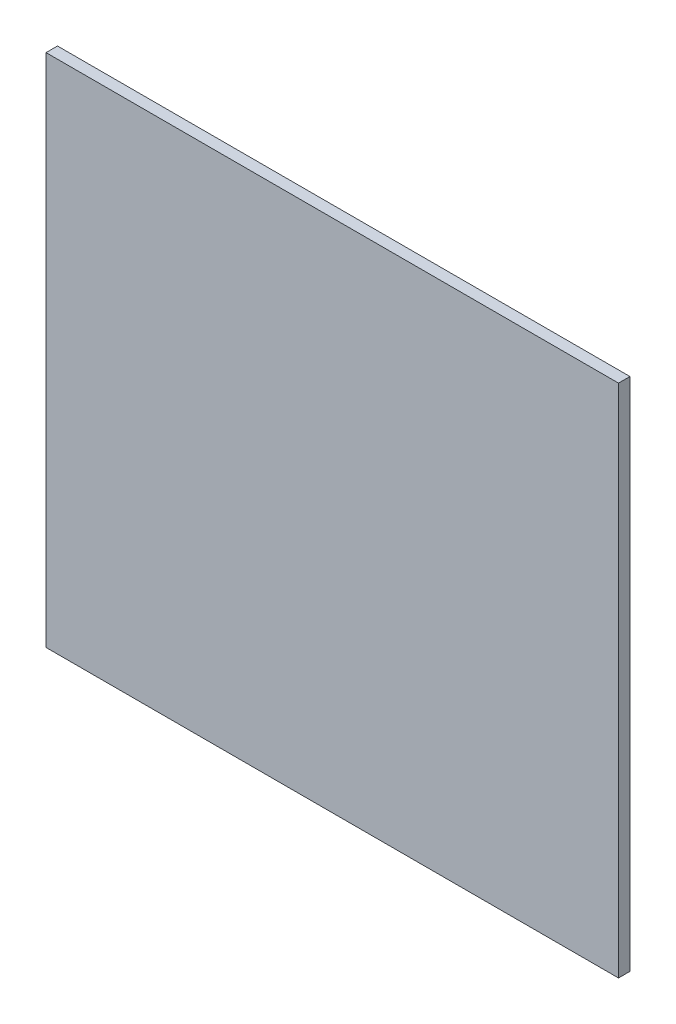
ISO-10303-21;
HEADER;
FILE_DESCRIPTION(('STEP AP214'),'2;1');
FILE_NAME('part.step','',(''),(''),'','','');
FILE_SCHEMA(('AUTOMOTIVE_DESIGN { 1 0 10303 214 1 1 1 1 }'));
ENDSEC;
DATA;
#1=APPLICATION_CONTEXT('core data for automotive mechanical design processes');
#2=APPLICATION_PROTOCOL_DEFINITION('international standard','automotive_design',2000,#1);
#3=PRODUCT_CONTEXT('',#1,'mechanical');
#4=PRODUCT('Part','Part','',(#3));
#5=PRODUCT_RELATED_PRODUCT_CATEGORY('part','',(#4));
#6=PRODUCT_DEFINITION_FORMATION('','',#4);
#7=PRODUCT_DEFINITION_CONTEXT('part definition',#1,'design');
#8=PRODUCT_DEFINITION('design','',#6,#7);
#9=PRODUCT_DEFINITION_SHAPE('','',#8);
#10=(LENGTH_UNIT() NAMED_UNIT(*) SI_UNIT(.MILLI.,.METRE.));
#11=(NAMED_UNIT(*) PLANE_ANGLE_UNIT() SI_UNIT($,.RADIAN.));
#12=(NAMED_UNIT(*) SI_UNIT($,.STERADIAN.) SOLID_ANGLE_UNIT());
#13=UNCERTAINTY_MEASURE_WITH_UNIT(LENGTH_MEASURE(1.E-05),#10,'distance_accuracy_value','');
#14=(GEOMETRIC_REPRESENTATION_CONTEXT(3) GLOBAL_UNCERTAINTY_ASSIGNED_CONTEXT((#13)) GLOBAL_UNIT_ASSIGNED_CONTEXT((#10,
#11,#12)) REPRESENTATION_CONTEXT('',''));
#15=CARTESIAN_POINT('',(0.,0.,0.));
#16=DIRECTION('',(0.,0.,1.));
#17=DIRECTION('',(1.,0.,0.));
#18=AXIS2_PLACEMENT_3D('',#15,#16,#17);
#19=CARTESIAN_POINT('',(250.,-225.,10.));
#20=DIRECTION('',(-1.,0.,0.));
#21=DIRECTION('',(0.,0.,1.));
#22=AXIS2_PLACEMENT_3D('',#19,#20,#21);
#23=PLANE('',#22);
#24=DIRECTION('',(0.,1.,0.));
#25=VECTOR('',#24,1.);
#26=CARTESIAN_POINT('',(250.,-225.,0.));
#27=LINE('',#26,#25);
#28=CARTESIAN_POINT('',(250.,-225.,0.));
#29=VERTEX_POINT('',#28);
#30=CARTESIAN_POINT('',(250.,225.,0.));
#31=VERTEX_POINT('',#30);
#32=EDGE_CURVE('E98',#29,#31,#27,.T.);
#33=ORIENTED_EDGE('',*,*,#32,.T.);
#34=DIRECTION('',(0.,0.,-1.));
#35=VECTOR('',#34,1.);
#36=CARTESIAN_POINT('',(250.,225.,10.));
#37=LINE('',#36,#35);
#38=CARTESIAN_POINT('',(250.,225.,10.));
#39=VERTEX_POINT('',#38);
#40=EDGE_CURVE('E11',#39,#31,#37,.T.);
#41=ORIENTED_EDGE('',*,*,#40,.F.);
#42=DIRECTION('',(0.,1.,0.));
#43=VECTOR('',#42,1.);
#44=CARTESIAN_POINT('',(250.,-225.,10.));
#45=LINE('',#44,#43);
#46=CARTESIAN_POINT('',(250.,-225.,10.));
#47=VERTEX_POINT('',#46);
#48=EDGE_CURVE('E86',#47,#39,#45,.T.);
#49=ORIENTED_EDGE('',*,*,#48,.F.);
#50=DIRECTION('',(0.,0.,-1.));
#51=VECTOR('',#50,1.);
#52=CARTESIAN_POINT('',(250.,-225.,10.));
#53=LINE('',#52,#51);
#54=EDGE_CURVE('E94',#47,#29,#53,.T.);
#55=ORIENTED_EDGE('',*,*,#54,.T.);
#56=EDGE_LOOP('',(#33,#41,#49,#55));
#57=FACE_BOUND('',#56,.T.);
#58=ADVANCED_FACE('F35',(#57),#23,.F.);
#59=CARTESIAN_POINT('',(-250.,225.,10.));
#60=DIRECTION('',(0.,-1.,0.));
#61=DIRECTION('',(0.,0.,-1.));
#62=AXIS2_PLACEMENT_3D('',#59,#60,#61);
#63=PLANE('',#62);
#64=DIRECTION('',(-1.,0.,0.));
#65=VECTOR('',#64,1.);
#66=CARTESIAN_POINT('',(-250.,225.,0.));
#67=LINE('',#66,#65);
#68=CARTESIAN_POINT('',(-250.,225.,0.));
#69=VERTEX_POINT('',#68);
#70=EDGE_CURVE('E90',#31,#69,#67,.T.);
#71=ORIENTED_EDGE('',*,*,#70,.T.);
#72=DIRECTION('',(0.,0.,-1.));
#73=VECTOR('',#72,1.);
#74=CARTESIAN_POINT('',(-250.,225.,10.));
#75=LINE('',#74,#73);
#76=CARTESIAN_POINT('',(-250.,225.,10.));
#77=VERTEX_POINT('',#76);
#78=EDGE_CURVE('E43',#77,#69,#75,.T.);
#79=ORIENTED_EDGE('',*,*,#78,.F.);
#80=DIRECTION('',(-1.,0.,0.));
#81=VECTOR('',#80,1.);
#82=CARTESIAN_POINT('',(-250.,225.,10.));
#83=LINE('',#82,#81);
#84=EDGE_CURVE('E81',#39,#77,#83,.T.);
#85=ORIENTED_EDGE('',*,*,#84,.F.);
#86=ORIENTED_EDGE('',*,*,#40,.T.);
#87=EDGE_LOOP('',(#71,#79,#85,#86));
#88=FACE_BOUND('',#87,.T.);
#89=ADVANCED_FACE('F89',(#88),#63,.F.);
#90=CARTESIAN_POINT('',(-250.,-225.,10.));
#91=DIRECTION('',(1.,0.,0.));
#92=DIRECTION('',(0.,0.,-1.));
#93=AXIS2_PLACEMENT_3D('',#90,#91,#92);
#94=PLANE('',#93);
#95=DIRECTION('',(0.,-1.,0.));
#96=VECTOR('',#95,1.);
#97=CARTESIAN_POINT('',(-250.,-225.,0.));
#98=LINE('',#97,#96);
#99=CARTESIAN_POINT('',(-250.,-225.,0.));
#100=VERTEX_POINT('',#99);
#101=EDGE_CURVE('E68',#69,#100,#98,.T.);
#102=ORIENTED_EDGE('',*,*,#101,.T.);
#103=DIRECTION('',(0.,0.,-1.));
#104=VECTOR('',#103,1.);
#105=CARTESIAN_POINT('',(-250.,-225.,10.));
#106=LINE('',#105,#104);
#107=CARTESIAN_POINT('',(-250.,-225.,10.));
#108=VERTEX_POINT('',#107);
#109=EDGE_CURVE('E91',#108,#100,#106,.T.);
#110=ORIENTED_EDGE('',*,*,#109,.F.);
#111=DIRECTION('',(0.,-1.,0.));
#112=VECTOR('',#111,1.);
#113=CARTESIAN_POINT('',(-250.,-225.,10.));
#114=LINE('',#113,#112);
#115=EDGE_CURVE('E84',#77,#108,#114,.T.);
#116=ORIENTED_EDGE('',*,*,#115,.F.);
#117=ORIENTED_EDGE('',*,*,#78,.T.);
#118=EDGE_LOOP('',(#102,#110,#116,#117));
#119=FACE_BOUND('',#118,.T.);
#120=ADVANCED_FACE('F92',(#119),#94,.F.);
#121=CARTESIAN_POINT('',(-250.,-225.,10.));
#122=DIRECTION('',(0.,1.,0.));
#123=DIRECTION('',(0.,0.,1.));
#124=AXIS2_PLACEMENT_3D('',#121,#122,#123);
#125=PLANE('',#124);
#126=DIRECTION('',(1.,0.,0.));
#127=VECTOR('',#126,1.);
#128=CARTESIAN_POINT('',(-250.,-225.,0.));
#129=LINE('',#128,#127);
#130=EDGE_CURVE('E74',#100,#29,#129,.T.);
#131=ORIENTED_EDGE('',*,*,#130,.T.);
#132=ORIENTED_EDGE('',*,*,#54,.F.);
#133=DIRECTION('',(1.,0.,0.));
#134=VECTOR('',#133,1.);
#135=CARTESIAN_POINT('',(-250.,-225.,10.));
#136=LINE('',#135,#134);
#137=EDGE_CURVE('E51',#108,#47,#136,.T.);
#138=ORIENTED_EDGE('',*,*,#137,.F.);
#139=ORIENTED_EDGE('',*,*,#109,.T.);
#140=EDGE_LOOP('',(#131,#132,#138,#139));
#141=FACE_BOUND('',#140,.T.);
#142=ADVANCED_FACE('F105',(#141),#125,.F.);
#143=CARTESIAN_POINT('',(0.,0.,10.));
#144=DIRECTION('',(0.,0.,-1.));
#145=DIRECTION('',(-1.,0.,0.));
#146=AXIS2_PLACEMENT_3D('',#143,#144,#145);
#147=PLANE('',#146);
#148=ORIENTED_EDGE('',*,*,#48,.T.);
#149=ORIENTED_EDGE('',*,*,#84,.T.);
#150=ORIENTED_EDGE('',*,*,#115,.T.);
#151=ORIENTED_EDGE('',*,*,#137,.T.);
#152=EDGE_LOOP('',(#148,#149,#150,#151));
#153=FACE_BOUND('',#152,.T.);
#154=ADVANCED_FACE('F82',(#153),#147,.F.);
#155=CARTESIAN_POINT('',(0.,0.,0.));
#156=DIRECTION('',(0.,0.,-1.));
#157=DIRECTION('',(-1.,0.,0.));
#158=AXIS2_PLACEMENT_3D('',#155,#156,#157);
#159=PLANE('',#158);
#160=ORIENTED_EDGE('',*,*,#32,.F.);
#161=ORIENTED_EDGE('',*,*,#130,.F.);
#162=ORIENTED_EDGE('',*,*,#101,.F.);
#163=ORIENTED_EDGE('',*,*,#70,.F.);
#164=EDGE_LOOP('',(#160,#161,#162,#163));
#165=FACE_BOUND('',#164,.T.);
#166=ADVANCED_FACE('F108',(#165),#159,.T.);
#167=CLOSED_SHELL('',(#58,#89,#120,#142,#154,#166));
#168=MANIFOLD_SOLID_BREP('B2',#167);
#169=ADVANCED_BREP_SHAPE_REPRESENTATION('',(#18,#168),#14);
#170=SHAPE_DEFINITION_REPRESENTATION(#9,#169);
ENDSEC;
END-ISO-10303-21;
